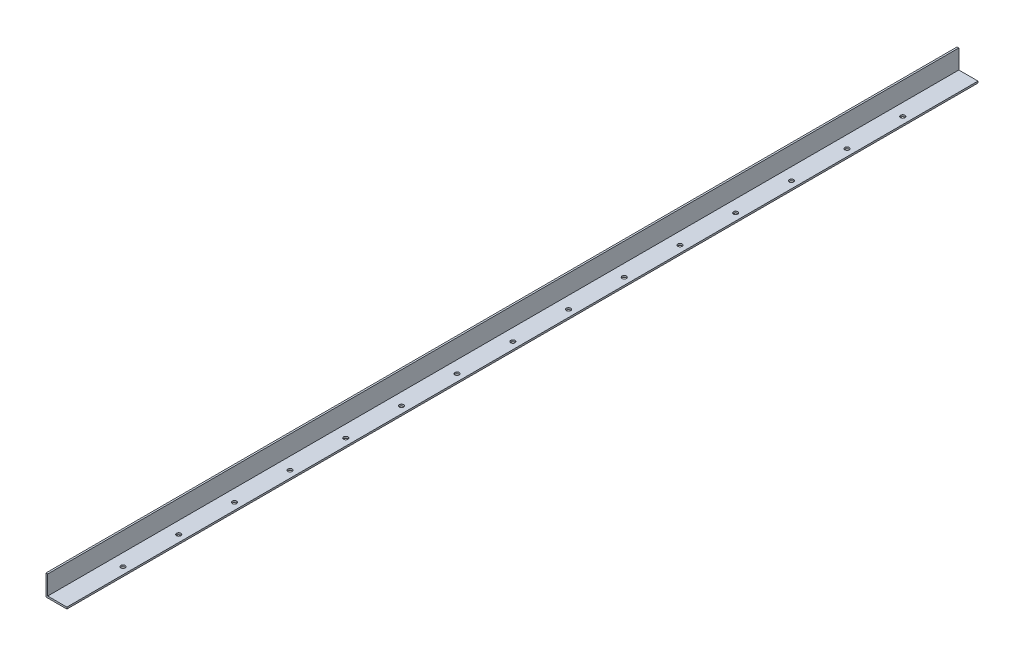
ISO-10303-21;
HEADER;
FILE_DESCRIPTION(('STEP AP214'),'2;1');
FILE_NAME('part.step','',(''),(''),'','','');
FILE_SCHEMA(('AUTOMOTIVE_DESIGN { 1 0 10303 214 1 1 1 1 }'));
ENDSEC;
DATA;
#1=APPLICATION_CONTEXT('core data for automotive mechanical design processes');
#2=APPLICATION_PROTOCOL_DEFINITION('international standard','automotive_design',2000,#1);
#3=PRODUCT_CONTEXT('',#1,'mechanical');
#4=PRODUCT('Part','Part','',(#3));
#5=PRODUCT_RELATED_PRODUCT_CATEGORY('part','',(#4));
#6=PRODUCT_DEFINITION_FORMATION('','',#4);
#7=PRODUCT_DEFINITION_CONTEXT('part definition',#1,'design');
#8=PRODUCT_DEFINITION('design','',#6,#7);
#9=PRODUCT_DEFINITION_SHAPE('','',#8);
#10=(LENGTH_UNIT() NAMED_UNIT(*) SI_UNIT(.MILLI.,.METRE.));
#11=(NAMED_UNIT(*) PLANE_ANGLE_UNIT() SI_UNIT($,.RADIAN.));
#12=(NAMED_UNIT(*) SI_UNIT($,.STERADIAN.) SOLID_ANGLE_UNIT());
#13=UNCERTAINTY_MEASURE_WITH_UNIT(LENGTH_MEASURE(1.E-05),#10,'distance_accuracy_value','');
#14=(GEOMETRIC_REPRESENTATION_CONTEXT(3) GLOBAL_UNCERTAINTY_ASSIGNED_CONTEXT((#13)) GLOBAL_UNIT_ASSIGNED_CONTEXT((#10,
#11,#12)) REPRESENTATION_CONTEXT('',''));
#15=CARTESIAN_POINT('',(0.,0.,0.));
#16=DIRECTION('',(0.,0.,1.));
#17=DIRECTION('',(1.,0.,0.));
#18=AXIS2_PLACEMENT_3D('',#15,#16,#17);
#19=CARTESIAN_POINT('',(25.4,-3.175,-706.4375));
#20=DIRECTION('',(0.,-1.,0.));
#21=DIRECTION('',(0.,0.,-1.));
#22=AXIS2_PLACEMENT_3D('',#19,#20,#21);
#23=CYLINDRICAL_SURFACE('',#22,3.96875);
#24=CARTESIAN_POINT('',(25.4,3.175,-706.4375));
#25=DIRECTION('',(0.,-1.,0.));
#26=DIRECTION('',(0.,0.,-1.));
#27=AXIS2_PLACEMENT_3D('',#24,#25,#26);
#28=CIRCLE('',#27,3.96875);
#29=CARTESIAN_POINT('',(25.4,3.175,-710.40625));
#30=VERTEX_POINT('',#29);
#31=EDGE_CURVE('E19',#30,#30,#28,.T.);
#32=ORIENTED_EDGE('',*,*,#31,.F.);
#33=EDGE_LOOP('',(#32));
#34=FACE_BOUND('',#33,.T.);
#35=CARTESIAN_POINT('',(25.4,0.,-706.4375));
#36=DIRECTION('',(0.,-1.,0.));
#37=DIRECTION('',(0.,0.,-1.));
#38=AXIS2_PLACEMENT_3D('',#35,#36,#37);
#39=CIRCLE('',#38,3.96875);
#40=CARTESIAN_POINT('',(25.4,0.,-710.40625));
#41=VERTEX_POINT('',#40);
#42=EDGE_CURVE('E100',#41,#41,#39,.F.);
#43=ORIENTED_EDGE('',*,*,#42,.F.);
#44=EDGE_LOOP('',(#43));
#45=FACE_BOUND('',#44,.T.);
#46=ADVANCED_FACE('F16',(#34,#45),#23,.F.);
#47=CARTESIAN_POINT('',(25.4,-3.175,-604.8375));
#48=DIRECTION('',(0.,-1.,0.));
#49=DIRECTION('',(0.,0.,-1.));
#50=AXIS2_PLACEMENT_3D('',#47,#48,#49);
#51=CYLINDRICAL_SURFACE('',#50,3.96875);
#52=CARTESIAN_POINT('',(25.4,3.175,-604.8375));
#53=DIRECTION('',(0.,-1.,0.));
#54=DIRECTION('',(0.,0.,-1.));
#55=AXIS2_PLACEMENT_3D('',#52,#53,#54);
#56=CIRCLE('',#55,3.96875);
#57=CARTESIAN_POINT('',(25.4,3.175,-608.80625));
#58=VERTEX_POINT('',#57);
#59=EDGE_CURVE('E180',#58,#58,#56,.T.);
#60=ORIENTED_EDGE('',*,*,#59,.F.);
#61=EDGE_LOOP('',(#60));
#62=FACE_BOUND('',#61,.T.);
#63=CARTESIAN_POINT('',(25.4,0.,-604.8375));
#64=DIRECTION('',(0.,-1.,0.));
#65=DIRECTION('',(0.,0.,-1.));
#66=AXIS2_PLACEMENT_3D('',#63,#64,#65);
#67=CIRCLE('',#66,3.96875);
#68=CARTESIAN_POINT('',(25.4,0.,-608.80625));
#69=VERTEX_POINT('',#68);
#70=EDGE_CURVE('E138',#69,#69,#67,.F.);
#71=ORIENTED_EDGE('',*,*,#70,.F.);
#72=EDGE_LOOP('',(#71));
#73=FACE_BOUND('',#72,.T.);
#74=ADVANCED_FACE('F190',(#62,#73),#51,.F.);
#75=CARTESIAN_POINT('',(25.4,-3.175,-503.2375));
#76=DIRECTION('',(0.,-1.,0.));
#77=DIRECTION('',(0.,0.,-1.));
#78=AXIS2_PLACEMENT_3D('',#75,#76,#77);
#79=CYLINDRICAL_SURFACE('',#78,3.96875);
#80=CARTESIAN_POINT('',(25.4,3.175,-503.2375));
#81=DIRECTION('',(0.,-1.,0.));
#82=DIRECTION('',(0.,0.,-1.));
#83=AXIS2_PLACEMENT_3D('',#80,#81,#82);
#84=CIRCLE('',#83,3.96875);
#85=CARTESIAN_POINT('',(25.4,3.175,-507.20625));
#86=VERTEX_POINT('',#85);
#87=EDGE_CURVE('E178',#86,#86,#84,.T.);
#88=ORIENTED_EDGE('',*,*,#87,.F.);
#89=EDGE_LOOP('',(#88));
#90=FACE_BOUND('',#89,.T.);
#91=CARTESIAN_POINT('',(25.4,0.,-503.2375));
#92=DIRECTION('',(0.,-1.,0.));
#93=DIRECTION('',(0.,0.,-1.));
#94=AXIS2_PLACEMENT_3D('',#91,#92,#93);
#95=CIRCLE('',#94,3.96875);
#96=CARTESIAN_POINT('',(25.4,0.,-507.20625));
#97=VERTEX_POINT('',#96);
#98=EDGE_CURVE('E135',#97,#97,#95,.F.);
#99=ORIENTED_EDGE('',*,*,#98,.F.);
#100=EDGE_LOOP('',(#99));
#101=FACE_BOUND('',#100,.T.);
#102=ADVANCED_FACE('F414',(#90,#101),#79,.F.);
#103=CARTESIAN_POINT('',(25.4,-3.175,-401.6375));
#104=DIRECTION('',(0.,-1.,0.));
#105=DIRECTION('',(0.,0.,-1.));
#106=AXIS2_PLACEMENT_3D('',#103,#104,#105);
#107=CYLINDRICAL_SURFACE('',#106,3.96875);
#108=CARTESIAN_POINT('',(25.4,3.175,-401.6375));
#109=DIRECTION('',(0.,-1.,0.));
#110=DIRECTION('',(0.,0.,-1.));
#111=AXIS2_PLACEMENT_3D('',#108,#109,#110);
#112=CIRCLE('',#111,3.96875);
#113=CARTESIAN_POINT('',(25.4,3.175,-405.60625));
#114=VERTEX_POINT('',#113);
#115=EDGE_CURVE('E175',#114,#114,#112,.T.);
#116=ORIENTED_EDGE('',*,*,#115,.F.);
#117=EDGE_LOOP('',(#116));
#118=FACE_BOUND('',#117,.T.);
#119=CARTESIAN_POINT('',(25.4,0.,-401.6375));
#120=DIRECTION('',(0.,-1.,0.));
#121=DIRECTION('',(0.,0.,-1.));
#122=AXIS2_PLACEMENT_3D('',#119,#120,#121);
#123=CIRCLE('',#122,3.96875);
#124=CARTESIAN_POINT('',(25.4,0.,-405.60625));
#125=VERTEX_POINT('',#124);
#126=EDGE_CURVE('E132',#125,#125,#123,.F.);
#127=ORIENTED_EDGE('',*,*,#126,.F.);
#128=EDGE_LOOP('',(#127));
#129=FACE_BOUND('',#128,.T.);
#130=ADVANCED_FACE('F404',(#118,#129),#107,.F.);
#131=CARTESIAN_POINT('',(25.4,-3.175,-300.0375));
#132=DIRECTION('',(0.,-1.,0.));
#133=DIRECTION('',(0.,0.,-1.));
#134=AXIS2_PLACEMENT_3D('',#131,#132,#133);
#135=CYLINDRICAL_SURFACE('',#134,3.96875);
#136=CARTESIAN_POINT('',(25.4,3.175,-300.0375));
#137=DIRECTION('',(0.,-1.,0.));
#138=DIRECTION('',(0.,0.,-1.));
#139=AXIS2_PLACEMENT_3D('',#136,#137,#138);
#140=CIRCLE('',#139,3.96875);
#141=CARTESIAN_POINT('',(25.4,3.175,-304.00625));
#142=VERTEX_POINT('',#141);
#143=EDGE_CURVE('E172',#142,#142,#140,.T.);
#144=ORIENTED_EDGE('',*,*,#143,.F.);
#145=EDGE_LOOP('',(#144));
#146=FACE_BOUND('',#145,.T.);
#147=CARTESIAN_POINT('',(25.4,0.,-300.0375));
#148=DIRECTION('',(0.,-1.,0.));
#149=DIRECTION('',(0.,0.,-1.));
#150=AXIS2_PLACEMENT_3D('',#147,#148,#149);
#151=CIRCLE('',#150,3.96875);
#152=CARTESIAN_POINT('',(25.4,0.,-304.00625));
#153=VERTEX_POINT('',#152);
#154=EDGE_CURVE('E129',#153,#153,#151,.F.);
#155=ORIENTED_EDGE('',*,*,#154,.F.);
#156=EDGE_LOOP('',(#155));
#157=FACE_BOUND('',#156,.T.);
#158=ADVANCED_FACE('F394',(#146,#157),#135,.F.);
#159=CARTESIAN_POINT('',(25.4,-3.175,-198.4375));
#160=DIRECTION('',(0.,-1.,0.));
#161=DIRECTION('',(0.,0.,-1.));
#162=AXIS2_PLACEMENT_3D('',#159,#160,#161);
#163=CYLINDRICAL_SURFACE('',#162,3.96875);
#164=CARTESIAN_POINT('',(25.4,3.175,-198.4375));
#165=DIRECTION('',(0.,-1.,0.));
#166=DIRECTION('',(0.,0.,-1.));
#167=AXIS2_PLACEMENT_3D('',#164,#165,#166);
#168=CIRCLE('',#167,3.96875);
#169=CARTESIAN_POINT('',(25.4,3.175,-202.40625));
#170=VERTEX_POINT('',#169);
#171=EDGE_CURVE('E169',#170,#170,#168,.T.);
#172=ORIENTED_EDGE('',*,*,#171,.F.);
#173=EDGE_LOOP('',(#172));
#174=FACE_BOUND('',#173,.T.);
#175=CARTESIAN_POINT('',(25.4,0.,-198.4375));
#176=DIRECTION('',(0.,-1.,0.));
#177=DIRECTION('',(0.,0.,-1.));
#178=AXIS2_PLACEMENT_3D('',#175,#176,#177);
#179=CIRCLE('',#178,3.96875);
#180=CARTESIAN_POINT('',(25.4,0.,-202.40625));
#181=VERTEX_POINT('',#180);
#182=EDGE_CURVE('E126',#181,#181,#179,.F.);
#183=ORIENTED_EDGE('',*,*,#182,.F.);
#184=EDGE_LOOP('',(#183));
#185=FACE_BOUND('',#184,.T.);
#186=ADVANCED_FACE('F384',(#174,#185),#163,.F.);
#187=CARTESIAN_POINT('',(25.4,-3.175,-96.8375));
#188=DIRECTION('',(0.,-1.,0.));
#189=DIRECTION('',(0.,0.,-1.));
#190=AXIS2_PLACEMENT_3D('',#187,#188,#189);
#191=CYLINDRICAL_SURFACE('',#190,3.96875);
#192=CARTESIAN_POINT('',(25.4,3.175,-96.8375));
#193=DIRECTION('',(0.,-1.,0.));
#194=DIRECTION('',(0.,0.,-1.));
#195=AXIS2_PLACEMENT_3D('',#192,#193,#194);
#196=CIRCLE('',#195,3.96875);
#197=CARTESIAN_POINT('',(25.4,3.175,-100.80625));
#198=VERTEX_POINT('',#197);
#199=EDGE_CURVE('E166',#198,#198,#196,.T.);
#200=ORIENTED_EDGE('',*,*,#199,.F.);
#201=EDGE_LOOP('',(#200));
#202=FACE_BOUND('',#201,.T.);
#203=CARTESIAN_POINT('',(25.4,0.,-96.8375));
#204=DIRECTION('',(0.,-1.,0.));
#205=DIRECTION('',(0.,0.,-1.));
#206=AXIS2_PLACEMENT_3D('',#203,#204,#205);
#207=CIRCLE('',#206,3.96875);
#208=CARTESIAN_POINT('',(25.4,0.,-100.80625));
#209=VERTEX_POINT('',#208);
#210=EDGE_CURVE('E123',#209,#209,#207,.F.);
#211=ORIENTED_EDGE('',*,*,#210,.F.);
#212=EDGE_LOOP('',(#211));
#213=FACE_BOUND('',#212,.T.);
#214=ADVANCED_FACE('F374',(#202,#213),#191,.F.);
#215=CARTESIAN_POINT('',(25.4,-3.175,4.7625));
#216=DIRECTION('',(0.,-1.,0.));
#217=DIRECTION('',(0.,0.,-1.));
#218=AXIS2_PLACEMENT_3D('',#215,#216,#217);
#219=CYLINDRICAL_SURFACE('',#218,3.96875);
#220=CARTESIAN_POINT('',(25.4,3.175,4.7625));
#221=DIRECTION('',(0.,-1.,0.));
#222=DIRECTION('',(0.,0.,-1.));
#223=AXIS2_PLACEMENT_3D('',#220,#221,#222);
#224=CIRCLE('',#223,3.96875);
#225=CARTESIAN_POINT('',(25.4,3.175,0.793749999999999));
#226=VERTEX_POINT('',#225);
#227=EDGE_CURVE('E163',#226,#226,#224,.T.);
#228=ORIENTED_EDGE('',*,*,#227,.F.);
#229=EDGE_LOOP('',(#228));
#230=FACE_BOUND('',#229,.T.);
#231=CARTESIAN_POINT('',(25.4,0.,4.7625));
#232=DIRECTION('',(0.,-1.,0.));
#233=DIRECTION('',(0.,0.,-1.));
#234=AXIS2_PLACEMENT_3D('',#231,#232,#233);
#235=CIRCLE('',#234,3.96875);
#236=CARTESIAN_POINT('',(25.4,0.,0.793749999999999));
#237=VERTEX_POINT('',#236);
#238=EDGE_CURVE('E120',#237,#237,#235,.F.);
#239=ORIENTED_EDGE('',*,*,#238,.F.);
#240=EDGE_LOOP('',(#239));
#241=FACE_BOUND('',#240,.T.);
#242=ADVANCED_FACE('F364',(#230,#241),#219,.F.);
#243=CARTESIAN_POINT('',(25.4,-3.175,106.3625));
#244=DIRECTION('',(0.,-1.,0.));
#245=DIRECTION('',(0.,0.,-1.));
#246=AXIS2_PLACEMENT_3D('',#243,#244,#245);
#247=CYLINDRICAL_SURFACE('',#246,3.96875);
#248=CARTESIAN_POINT('',(25.4,3.175,106.3625));
#249=DIRECTION('',(0.,-1.,0.));
#250=DIRECTION('',(0.,0.,-1.));
#251=AXIS2_PLACEMENT_3D('',#248,#249,#250);
#252=CIRCLE('',#251,3.96875);
#253=CARTESIAN_POINT('',(25.4,3.175,102.39375));
#254=VERTEX_POINT('',#253);
#255=EDGE_CURVE('E160',#254,#254,#252,.T.);
#256=ORIENTED_EDGE('',*,*,#255,.F.);
#257=EDGE_LOOP('',(#256));
#258=FACE_BOUND('',#257,.T.);
#259=CARTESIAN_POINT('',(25.4,0.,106.3625));
#260=DIRECTION('',(0.,-1.,0.));
#261=DIRECTION('',(0.,0.,-1.));
#262=AXIS2_PLACEMENT_3D('',#259,#260,#261);
#263=CIRCLE('',#262,3.96875);
#264=CARTESIAN_POINT('',(25.4,0.,102.39375));
#265=VERTEX_POINT('',#264);
#266=EDGE_CURVE('E117',#265,#265,#263,.F.);
#267=ORIENTED_EDGE('',*,*,#266,.F.);
#268=EDGE_LOOP('',(#267));
#269=FACE_BOUND('',#268,.T.);
#270=ADVANCED_FACE('F354',(#258,#269),#247,.F.);
#271=CARTESIAN_POINT('',(25.4,-3.175,207.9625));
#272=DIRECTION('',(0.,-1.,0.));
#273=DIRECTION('',(0.,0.,-1.));
#274=AXIS2_PLACEMENT_3D('',#271,#272,#273);
#275=CYLINDRICAL_SURFACE('',#274,3.96875);
#276=CARTESIAN_POINT('',(25.4,3.175,207.9625));
#277=DIRECTION('',(0.,-1.,0.));
#278=DIRECTION('',(0.,0.,-1.));
#279=AXIS2_PLACEMENT_3D('',#276,#277,#278);
#280=CIRCLE('',#279,3.96875);
#281=CARTESIAN_POINT('',(25.4,3.175,203.99375));
#282=VERTEX_POINT('',#281);
#283=EDGE_CURVE('E157',#282,#282,#280,.T.);
#284=ORIENTED_EDGE('',*,*,#283,.F.);
#285=EDGE_LOOP('',(#284));
#286=FACE_BOUND('',#285,.T.);
#287=CARTESIAN_POINT('',(25.4,0.,207.9625));
#288=DIRECTION('',(0.,-1.,0.));
#289=DIRECTION('',(0.,0.,-1.));
#290=AXIS2_PLACEMENT_3D('',#287,#288,#289);
#291=CIRCLE('',#290,3.96875);
#292=CARTESIAN_POINT('',(25.4,0.,203.99375));
#293=VERTEX_POINT('',#292);
#294=EDGE_CURVE('E114',#293,#293,#291,.F.);
#295=ORIENTED_EDGE('',*,*,#294,.F.);
#296=EDGE_LOOP('',(#295));
#297=FACE_BOUND('',#296,.T.);
#298=ADVANCED_FACE('F344',(#286,#297),#275,.F.);
#299=CARTESIAN_POINT('',(25.4,-3.175,309.5625));
#300=DIRECTION('',(0.,-1.,0.));
#301=DIRECTION('',(0.,0.,-1.));
#302=AXIS2_PLACEMENT_3D('',#299,#300,#301);
#303=CYLINDRICAL_SURFACE('',#302,3.96875);
#304=CARTESIAN_POINT('',(25.4,3.175,309.5625));
#305=DIRECTION('',(0.,-1.,0.));
#306=DIRECTION('',(0.,0.,-1.));
#307=AXIS2_PLACEMENT_3D('',#304,#305,#306);
#308=CIRCLE('',#307,3.96875);
#309=CARTESIAN_POINT('',(25.4,3.175,305.59375));
#310=VERTEX_POINT('',#309);
#311=EDGE_CURVE('E154',#310,#310,#308,.T.);
#312=ORIENTED_EDGE('',*,*,#311,.F.);
#313=EDGE_LOOP('',(#312));
#314=FACE_BOUND('',#313,.T.);
#315=CARTESIAN_POINT('',(25.4,0.,309.5625));
#316=DIRECTION('',(0.,-1.,0.));
#317=DIRECTION('',(0.,0.,-1.));
#318=AXIS2_PLACEMENT_3D('',#315,#316,#317);
#319=CIRCLE('',#318,3.96875);
#320=CARTESIAN_POINT('',(25.4,0.,305.59375));
#321=VERTEX_POINT('',#320);
#322=EDGE_CURVE('E111',#321,#321,#319,.F.);
#323=ORIENTED_EDGE('',*,*,#322,.F.);
#324=EDGE_LOOP('',(#323));
#325=FACE_BOUND('',#324,.T.);
#326=ADVANCED_FACE('F334',(#314,#325),#303,.F.);
#327=CARTESIAN_POINT('',(25.4,-3.175,411.1625));
#328=DIRECTION('',(0.,-1.,0.));
#329=DIRECTION('',(0.,0.,-1.));
#330=AXIS2_PLACEMENT_3D('',#327,#328,#329);
#331=CYLINDRICAL_SURFACE('',#330,3.96875);
#332=CARTESIAN_POINT('',(25.4,3.175,411.1625));
#333=DIRECTION('',(0.,-1.,0.));
#334=DIRECTION('',(0.,0.,-1.));
#335=AXIS2_PLACEMENT_3D('',#332,#333,#334);
#336=CIRCLE('',#335,3.96875);
#337=CARTESIAN_POINT('',(25.4,3.175,407.19375));
#338=VERTEX_POINT('',#337);
#339=EDGE_CURVE('E151',#338,#338,#336,.T.);
#340=ORIENTED_EDGE('',*,*,#339,.F.);
#341=EDGE_LOOP('',(#340));
#342=FACE_BOUND('',#341,.T.);
#343=CARTESIAN_POINT('',(25.4,0.,411.1625));
#344=DIRECTION('',(0.,-1.,0.));
#345=DIRECTION('',(0.,0.,-1.));
#346=AXIS2_PLACEMENT_3D('',#343,#344,#345);
#347=CIRCLE('',#346,3.96875);
#348=CARTESIAN_POINT('',(25.4,0.,407.19375));
#349=VERTEX_POINT('',#348);
#350=EDGE_CURVE('E108',#349,#349,#347,.F.);
#351=ORIENTED_EDGE('',*,*,#350,.F.);
#352=EDGE_LOOP('',(#351));
#353=FACE_BOUND('',#352,.T.);
#354=ADVANCED_FACE('F324',(#342,#353),#331,.F.);
#355=CARTESIAN_POINT('',(25.4,-3.175,512.7625));
#356=DIRECTION('',(0.,-1.,0.));
#357=DIRECTION('',(0.,0.,-1.));
#358=AXIS2_PLACEMENT_3D('',#355,#356,#357);
#359=CYLINDRICAL_SURFACE('',#358,3.96875);
#360=CARTESIAN_POINT('',(25.4,3.175,512.7625));
#361=DIRECTION('',(0.,-1.,0.));
#362=DIRECTION('',(0.,0.,-1.));
#363=AXIS2_PLACEMENT_3D('',#360,#361,#362);
#364=CIRCLE('',#363,3.96875);
#365=CARTESIAN_POINT('',(25.4,3.175,508.79375));
#366=VERTEX_POINT('',#365);
#367=EDGE_CURVE('E148',#366,#366,#364,.T.);
#368=ORIENTED_EDGE('',*,*,#367,.F.);
#369=EDGE_LOOP('',(#368));
#370=FACE_BOUND('',#369,.T.);
#371=CARTESIAN_POINT('',(25.4,0.,512.7625));
#372=DIRECTION('',(0.,-1.,0.));
#373=DIRECTION('',(0.,0.,-1.));
#374=AXIS2_PLACEMENT_3D('',#371,#372,#373);
#375=CIRCLE('',#374,3.96875);
#376=CARTESIAN_POINT('',(25.4,0.,508.79375));
#377=VERTEX_POINT('',#376);
#378=EDGE_CURVE('E105',#377,#377,#375,.F.);
#379=ORIENTED_EDGE('',*,*,#378,.F.);
#380=EDGE_LOOP('',(#379));
#381=FACE_BOUND('',#380,.T.);
#382=ADVANCED_FACE('F314',(#370,#381),#359,.F.);
#383=CARTESIAN_POINT('',(25.4,-3.175,614.3625));
#384=DIRECTION('',(0.,-1.,0.));
#385=DIRECTION('',(0.,0.,-1.));
#386=AXIS2_PLACEMENT_3D('',#383,#384,#385);
#387=CYLINDRICAL_SURFACE('',#386,3.96875);
#388=CARTESIAN_POINT('',(25.4,3.175,614.3625));
#389=DIRECTION('',(0.,-1.,0.));
#390=DIRECTION('',(0.,0.,-1.));
#391=AXIS2_PLACEMENT_3D('',#388,#389,#390);
#392=CIRCLE('',#391,3.96875);
#393=CARTESIAN_POINT('',(25.4,3.175,610.39375));
#394=VERTEX_POINT('',#393);
#395=EDGE_CURVE('E145',#394,#394,#392,.T.);
#396=ORIENTED_EDGE('',*,*,#395,.F.);
#397=EDGE_LOOP('',(#396));
#398=FACE_BOUND('',#397,.T.);
#399=CARTESIAN_POINT('',(25.4,0.,614.3625));
#400=DIRECTION('',(0.,-1.,0.));
#401=DIRECTION('',(0.,0.,-1.));
#402=AXIS2_PLACEMENT_3D('',#399,#400,#401);
#403=CIRCLE('',#402,3.96875);
#404=CARTESIAN_POINT('',(25.4,0.,610.39375));
#405=VERTEX_POINT('',#404);
#406=EDGE_CURVE('E94',#405,#405,#403,.F.);
#407=ORIENTED_EDGE('',*,*,#406,.F.);
#408=EDGE_LOOP('',(#407));
#409=FACE_BOUND('',#408,.T.);
#410=ADVANCED_FACE('F304',(#398,#409),#387,.F.);
#411=CARTESIAN_POINT('',(25.4,-3.175,715.9625));
#412=DIRECTION('',(0.,-1.,0.));
#413=DIRECTION('',(0.,0.,-1.));
#414=AXIS2_PLACEMENT_3D('',#411,#412,#413);
#415=CYLINDRICAL_SURFACE('',#414,3.96875);
#416=CARTESIAN_POINT('',(25.4,3.175,715.9625));
#417=DIRECTION('',(0.,-1.,0.));
#418=DIRECTION('',(0.,0.,-1.));
#419=AXIS2_PLACEMENT_3D('',#416,#417,#418);
#420=CIRCLE('',#419,3.96875);
#421=CARTESIAN_POINT('',(25.4,3.175,711.99375));
#422=VERTEX_POINT('',#421);
#423=EDGE_CURVE('E101',#422,#422,#420,.T.);
#424=ORIENTED_EDGE('',*,*,#423,.F.);
#425=EDGE_LOOP('',(#424));
#426=FACE_BOUND('',#425,.T.);
#427=CARTESIAN_POINT('',(25.4,0.,715.9625));
#428=DIRECTION('',(0.,-1.,0.));
#429=DIRECTION('',(0.,0.,-1.));
#430=AXIS2_PLACEMENT_3D('',#427,#428,#429);
#431=CIRCLE('',#430,3.96875);
#432=CARTESIAN_POINT('',(25.4,0.,711.99375));
#433=VERTEX_POINT('',#432);
#434=EDGE_CURVE('E91',#433,#433,#431,.F.);
#435=ORIENTED_EDGE('',*,*,#434,.F.);
#436=EDGE_LOOP('',(#435));
#437=FACE_BOUND('',#436,.T.);
#438=ADVANCED_FACE('F295',(#426,#437),#415,.F.);
#439=CARTESIAN_POINT('',(38.1,0.,-831.05625));
#440=DIRECTION('',(1.,0.,0.));
#441=DIRECTION('',(0.,0.,-1.));
#442=AXIS2_PLACEMENT_3D('',#439,#440,#441);
#443=PLANE('',#442);
#444=DIRECTION('',(0.,0.,-1.));
#445=VECTOR('',#444,1.);
#446=CARTESIAN_POINT('',(38.1,0.,-831.05625));
#447=LINE('',#446,#445);
#448=CARTESIAN_POINT('',(38.1,0.,-831.05625));
#449=VERTEX_POINT('',#448);
#450=CARTESIAN_POINT('',(38.1,0.,831.05625));
#451=VERTEX_POINT('',#450);
#452=EDGE_CURVE('E98',#449,#451,#447,.F.);
#453=ORIENTED_EDGE('',*,*,#452,.F.);
#454=DIRECTION('',(0.,1.,0.));
#455=VECTOR('',#454,1.);
#456=CARTESIAN_POINT('',(38.1,0.,-831.05625));
#457=LINE('',#456,#455);
#458=CARTESIAN_POINT('',(38.1,3.175,-831.05625));
#459=VERTEX_POINT('',#458);
#460=EDGE_CURVE('E74',#449,#459,#457,.T.);
#461=ORIENTED_EDGE('',*,*,#460,.T.);
#462=DIRECTION('',(0.,0.,1.));
#463=VECTOR('',#462,1.);
#464=CARTESIAN_POINT('',(38.1,3.175,-831.05625));
#465=LINE('',#464,#463);
#466=CARTESIAN_POINT('',(38.1,3.175,831.05625));
#467=VERTEX_POINT('',#466);
#468=EDGE_CURVE('E70',#467,#459,#465,.F.);
#469=ORIENTED_EDGE('',*,*,#468,.F.);
#470=DIRECTION('',(0.,1.,0.));
#471=VECTOR('',#470,1.);
#472=CARTESIAN_POINT('',(38.1,0.,831.05625));
#473=LINE('',#472,#471);
#474=EDGE_CURVE('E67',#451,#467,#473,.T.);
#475=ORIENTED_EDGE('',*,*,#474,.F.);
#476=EDGE_LOOP('',(#453,#461,#469,#475));
#477=FACE_BOUND('',#476,.T.);
#478=ADVANCED_FACE('F72',(#477),#443,.T.);
#479=CARTESIAN_POINT('',(38.1,3.175,-831.05625));
#480=DIRECTION('',(0.,1.,0.));
#481=DIRECTION('',(0.,0.,1.));
#482=AXIS2_PLACEMENT_3D('',#479,#480,#481);
#483=PLANE('',#482);
#484=ORIENTED_EDGE('',*,*,#423,.T.);
#485=EDGE_LOOP('',(#484));
#486=FACE_BOUND('',#485,.T.);
#487=ORIENTED_EDGE('',*,*,#395,.T.);
#488=EDGE_LOOP('',(#487));
#489=FACE_BOUND('',#488,.T.);
#490=ORIENTED_EDGE('',*,*,#367,.T.);
#491=EDGE_LOOP('',(#490));
#492=FACE_BOUND('',#491,.T.);
#493=ORIENTED_EDGE('',*,*,#339,.T.);
#494=EDGE_LOOP('',(#493));
#495=FACE_BOUND('',#494,.T.);
#496=ORIENTED_EDGE('',*,*,#311,.T.);
#497=EDGE_LOOP('',(#496));
#498=FACE_BOUND('',#497,.T.);
#499=ORIENTED_EDGE('',*,*,#283,.T.);
#500=EDGE_LOOP('',(#499));
#501=FACE_BOUND('',#500,.T.);
#502=ORIENTED_EDGE('',*,*,#255,.T.);
#503=EDGE_LOOP('',(#502));
#504=FACE_BOUND('',#503,.T.);
#505=ORIENTED_EDGE('',*,*,#227,.T.);
#506=EDGE_LOOP('',(#505));
#507=FACE_BOUND('',#506,.T.);
#508=ORIENTED_EDGE('',*,*,#199,.T.);
#509=EDGE_LOOP('',(#508));
#510=FACE_BOUND('',#509,.T.);
#511=ORIENTED_EDGE('',*,*,#171,.T.);
#512=EDGE_LOOP('',(#511));
#513=FACE_BOUND('',#512,.T.);
#514=ORIENTED_EDGE('',*,*,#143,.T.);
#515=EDGE_LOOP('',(#514));
#516=FACE_BOUND('',#515,.T.);
#517=ORIENTED_EDGE('',*,*,#115,.T.);
#518=EDGE_LOOP('',(#517));
#519=FACE_BOUND('',#518,.T.);
#520=ORIENTED_EDGE('',*,*,#87,.T.);
#521=EDGE_LOOP('',(#520));
#522=FACE_BOUND('',#521,.T.);
#523=ORIENTED_EDGE('',*,*,#59,.T.);
#524=EDGE_LOOP('',(#523));
#525=FACE_BOUND('',#524,.T.);
#526=ORIENTED_EDGE('',*,*,#31,.T.);
#527=EDGE_LOOP('',(#526));
#528=FACE_BOUND('',#527,.T.);
#529=ORIENTED_EDGE('',*,*,#468,.T.);
#530=DIRECTION('',(1.,0.,0.));
#531=VECTOR('',#530,1.);
#532=CARTESIAN_POINT('',(0.,3.175,-831.05625));
#533=LINE('',#532,#531);
#534=CARTESIAN_POINT('',(3.175,3.175,-831.05625));
#535=VERTEX_POINT('',#534);
#536=EDGE_CURVE('E221',#459,#535,#533,.F.);
#537=ORIENTED_EDGE('',*,*,#536,.T.);
#538=DIRECTION('',(0.,0.,-1.));
#539=VECTOR('',#538,1.);
#540=CARTESIAN_POINT('',(3.175,3.175,-831.05625));
#541=LINE('',#540,#539);
#542=CARTESIAN_POINT('',(3.175,3.175,831.05625));
#543=VERTEX_POINT('',#542);
#544=EDGE_CURVE('E82',#543,#535,#541,.T.);
#545=ORIENTED_EDGE('',*,*,#544,.F.);
#546=DIRECTION('',(1.,0.,0.));
#547=VECTOR('',#546,1.);
#548=CARTESIAN_POINT('',(0.,3.175,831.05625));
#549=LINE('',#548,#547);
#550=EDGE_CURVE('E79',#467,#543,#549,.F.);
#551=ORIENTED_EDGE('',*,*,#550,.F.);
#552=EDGE_LOOP('',(#529,#537,#545,#551));
#553=FACE_BOUND('',#552,.T.);
#554=ADVANCED_FACE('F80',(#486,#489,#492,#495,#498,#501,#504,#507,#510,#513,#516,#519,#522,#525,
#528,#553),#483,.T.);
#555=CARTESIAN_POINT('',(3.175,3.175,-831.05625));
#556=DIRECTION('',(1.,0.,0.));
#557=DIRECTION('',(0.,0.,-1.));
#558=AXIS2_PLACEMENT_3D('',#555,#556,#557);
#559=PLANE('',#558);
#560=ORIENTED_EDGE('',*,*,#544,.T.);
#561=DIRECTION('',(0.,1.,0.));
#562=VECTOR('',#561,1.);
#563=CARTESIAN_POINT('',(3.175,0.,-831.05625));
#564=LINE('',#563,#562);
#565=CARTESIAN_POINT('',(3.175,38.1,-831.05625));
#566=VERTEX_POINT('',#565);
#567=EDGE_CURVE('E219',#535,#566,#564,.T.);
#568=ORIENTED_EDGE('',*,*,#567,.T.);
#569=DIRECTION('',(0.,0.,1.));
#570=VECTOR('',#569,1.);
#571=CARTESIAN_POINT('',(3.175,38.1,-831.05625));
#572=LINE('',#571,#570);
#573=CARTESIAN_POINT('',(3.175,38.1,831.05625));
#574=VERTEX_POINT('',#573);
#575=EDGE_CURVE('E211',#574,#566,#572,.F.);
#576=ORIENTED_EDGE('',*,*,#575,.F.);
#577=DIRECTION('',(0.,1.,0.));
#578=VECTOR('',#577,1.);
#579=CARTESIAN_POINT('',(3.175,0.,831.05625));
#580=LINE('',#579,#578);
#581=EDGE_CURVE('E85',#543,#574,#580,.T.);
#582=ORIENTED_EDGE('',*,*,#581,.F.);
#583=EDGE_LOOP('',(#560,#568,#576,#582));
#584=FACE_BOUND('',#583,.T.);
#585=ADVANCED_FACE('F196',(#584),#559,.T.);
#586=CARTESIAN_POINT('',(0.,0.,-831.05625));
#587=DIRECTION('',(0.,-1.,0.));
#588=DIRECTION('',(0.,0.,-1.));
#589=AXIS2_PLACEMENT_3D('',#586,#587,#588);
#590=PLANE('',#589);
#591=ORIENTED_EDGE('',*,*,#434,.T.);
#592=EDGE_LOOP('',(#591));
#593=FACE_BOUND('',#592,.T.);
#594=ORIENTED_EDGE('',*,*,#406,.T.);
#595=EDGE_LOOP('',(#594));
#596=FACE_BOUND('',#595,.T.);
#597=ORIENTED_EDGE('',*,*,#378,.T.);
#598=EDGE_LOOP('',(#597));
#599=FACE_BOUND('',#598,.T.);
#600=ORIENTED_EDGE('',*,*,#350,.T.);
#601=EDGE_LOOP('',(#600));
#602=FACE_BOUND('',#601,.T.);
#603=ORIENTED_EDGE('',*,*,#322,.T.);
#604=EDGE_LOOP('',(#603));
#605=FACE_BOUND('',#604,.T.);
#606=ORIENTED_EDGE('',*,*,#294,.T.);
#607=EDGE_LOOP('',(#606));
#608=FACE_BOUND('',#607,.T.);
#609=ORIENTED_EDGE('',*,*,#266,.T.);
#610=EDGE_LOOP('',(#609));
#611=FACE_BOUND('',#610,.T.);
#612=ORIENTED_EDGE('',*,*,#238,.T.);
#613=EDGE_LOOP('',(#612));
#614=FACE_BOUND('',#613,.T.);
#615=ORIENTED_EDGE('',*,*,#210,.T.);
#616=EDGE_LOOP('',(#615));
#617=FACE_BOUND('',#616,.T.);
#618=ORIENTED_EDGE('',*,*,#182,.T.);
#619=EDGE_LOOP('',(#618));
#620=FACE_BOUND('',#619,.T.);
#621=ORIENTED_EDGE('',*,*,#154,.T.);
#622=EDGE_LOOP('',(#621));
#623=FACE_BOUND('',#622,.T.);
#624=ORIENTED_EDGE('',*,*,#126,.T.);
#625=EDGE_LOOP('',(#624));
#626=FACE_BOUND('',#625,.T.);
#627=ORIENTED_EDGE('',*,*,#98,.T.);
#628=EDGE_LOOP('',(#627));
#629=FACE_BOUND('',#628,.T.);
#630=ORIENTED_EDGE('',*,*,#70,.T.);
#631=EDGE_LOOP('',(#630));
#632=FACE_BOUND('',#631,.T.);
#633=ORIENTED_EDGE('',*,*,#42,.T.);
#634=EDGE_LOOP('',(#633));
#635=FACE_BOUND('',#634,.T.);
#636=DIRECTION('',(0.,0.,1.));
#637=VECTOR('',#636,1.);
#638=CARTESIAN_POINT('',(0.,0.,-831.05625));
#639=LINE('',#638,#637);
#640=CARTESIAN_POINT('',(0.,0.,-831.05625));
#641=VERTEX_POINT('',#640);
#642=CARTESIAN_POINT('',(0.,0.,831.05625));
#643=VERTEX_POINT('',#642);
#644=EDGE_CURVE('E201',#641,#643,#639,.T.);
#645=ORIENTED_EDGE('',*,*,#644,.F.);
#646=DIRECTION('',(1.,0.,0.));
#647=VECTOR('',#646,1.);
#648=CARTESIAN_POINT('',(0.,0.,-831.05625));
#649=LINE('',#648,#647);
#650=EDGE_CURVE('E203',#641,#449,#649,.T.);
#651=ORIENTED_EDGE('',*,*,#650,.T.);
#652=ORIENTED_EDGE('',*,*,#452,.T.);
#653=DIRECTION('',(1.,0.,0.));
#654=VECTOR('',#653,1.);
#655=CARTESIAN_POINT('',(0.,0.,831.05625));
#656=LINE('',#655,#654);
#657=EDGE_CURVE('E90',#643,#451,#656,.T.);
#658=ORIENTED_EDGE('',*,*,#657,.F.);
#659=EDGE_LOOP('',(#645,#651,#652,#658));
#660=FACE_BOUND('',#659,.T.);
#661=ADVANCED_FACE('F193',(#593,#596,#599,#602,#605,#608,#611,#614,#617,#620,#623,#626,#629,
#632,#635,#660),#590,.T.);
#662=CARTESIAN_POINT('',(0.,0.,831.05625));
#663=DIRECTION('',(0.,0.,1.));
#664=DIRECTION('',(1.,0.,0.));
#665=AXIS2_PLACEMENT_3D('',#662,#663,#664);
#666=PLANE('',#665);
#667=DIRECTION('',(0.,1.,0.));
#668=VECTOR('',#667,1.);
#669=CARTESIAN_POINT('',(0.,38.1,831.05625));
#670=LINE('',#669,#668);
#671=CARTESIAN_POINT('',(0.,38.1,831.05625));
#672=VERTEX_POINT('',#671);
#673=EDGE_CURVE('E206',#643,#672,#670,.T.);
#674=ORIENTED_EDGE('',*,*,#673,.F.);
#675=ORIENTED_EDGE('',*,*,#657,.T.);
#676=ORIENTED_EDGE('',*,*,#474,.T.);
#677=ORIENTED_EDGE('',*,*,#550,.T.);
#678=ORIENTED_EDGE('',*,*,#581,.T.);
#679=DIRECTION('',(1.,0.,0.));
#680=VECTOR('',#679,1.);
#681=CARTESIAN_POINT('',(3.175,38.1,831.05625));
#682=LINE('',#681,#680);
#683=EDGE_CURVE('E225',#672,#574,#682,.T.);
#684=ORIENTED_EDGE('',*,*,#683,.F.);
#685=EDGE_LOOP('',(#674,#675,#676,#677,#678,#684));
#686=FACE_BOUND('',#685,.T.);
#687=ADVANCED_FACE('F89',(#686),#666,.T.);
#688=CARTESIAN_POINT('',(3.175,38.1,-831.05625));
#689=DIRECTION('',(0.,1.,0.));
#690=DIRECTION('',(0.,0.,1.));
#691=AXIS2_PLACEMENT_3D('',#688,#689,#690);
#692=PLANE('',#691);
#693=ORIENTED_EDGE('',*,*,#575,.T.);
#694=DIRECTION('',(1.,0.,0.));
#695=VECTOR('',#694,1.);
#696=CARTESIAN_POINT('',(0.,38.1,-831.05625));
#697=LINE('',#696,#695);
#698=CARTESIAN_POINT('',(0.,38.1,-831.05625));
#699=VERTEX_POINT('',#698);
#700=EDGE_CURVE('E34',#566,#699,#697,.F.);
#701=ORIENTED_EDGE('',*,*,#700,.T.);
#702=DIRECTION('',(0.,0.,1.));
#703=VECTOR('',#702,1.);
#704=CARTESIAN_POINT('',(0.,38.1,-831.05625));
#705=LINE('',#704,#703);
#706=EDGE_CURVE('E25',#672,#699,#705,.F.);
#707=ORIENTED_EDGE('',*,*,#706,.F.);
#708=ORIENTED_EDGE('',*,*,#683,.T.);
#709=EDGE_LOOP('',(#693,#701,#707,#708));
#710=FACE_BOUND('',#709,.T.);
#711=ADVANCED_FACE('F230',(#710),#692,.T.);
#712=CARTESIAN_POINT('',(0.,0.,-831.05625));
#713=DIRECTION('',(0.,0.,1.));
#714=DIRECTION('',(1.,0.,0.));
#715=AXIS2_PLACEMENT_3D('',#712,#713,#714);
#716=PLANE('',#715);
#717=ORIENTED_EDGE('',*,*,#700,.F.);
#718=ORIENTED_EDGE('',*,*,#567,.F.);
#719=ORIENTED_EDGE('',*,*,#536,.F.);
#720=ORIENTED_EDGE('',*,*,#460,.F.);
#721=ORIENTED_EDGE('',*,*,#650,.F.);
#722=DIRECTION('',(0.,1.,0.));
#723=VECTOR('',#722,1.);
#724=CARTESIAN_POINT('',(0.,38.1,-831.05625));
#725=LINE('',#724,#723);
#726=EDGE_CURVE('E11',#699,#641,#725,.F.);
#727=ORIENTED_EDGE('',*,*,#726,.F.);
#728=EDGE_LOOP('',(#717,#718,#719,#720,#721,#727));
#729=FACE_BOUND('',#728,.T.);
#730=ADVANCED_FACE('F209',(#729),#716,.F.);
#731=CARTESIAN_POINT('',(0.,38.1,-831.05625));
#732=DIRECTION('',(-1.,0.,0.));
#733=DIRECTION('',(0.,0.,1.));
#734=AXIS2_PLACEMENT_3D('',#731,#732,#733);
#735=PLANE('',#734);
#736=ORIENTED_EDGE('',*,*,#706,.T.);
#737=ORIENTED_EDGE('',*,*,#726,.T.);
#738=ORIENTED_EDGE('',*,*,#644,.T.);
#739=ORIENTED_EDGE('',*,*,#673,.T.);
#740=EDGE_LOOP('',(#736,#737,#738,#739));
#741=FACE_BOUND('',#740,.T.);
#742=ADVANCED_FACE('F213',(#741),#735,.T.);
#743=CLOSED_SHELL('',(#46,#74,#102,#130,#158,#186,#214,#242,#270,#298,#326,#354,#382,#410,#438,
#478,#554,#585,#661,#687,#711,#730,#742));
#744=MANIFOLD_SOLID_BREP('B1',#743);
#745=ADVANCED_BREP_SHAPE_REPRESENTATION('',(#18,#744),#14);
#746=SHAPE_DEFINITION_REPRESENTATION(#9,#745);
ENDSEC;
END-ISO-10303-21;
